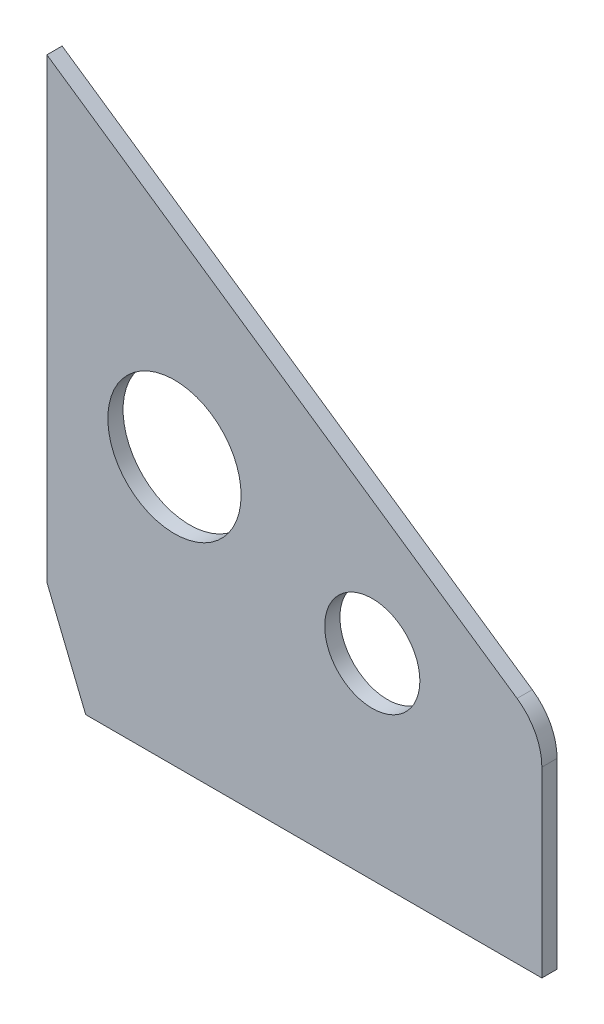
ISO-10303-21;
HEADER;
FILE_DESCRIPTION(('STEP AP214'),'2;1');
FILE_NAME('part.step','',(''),(''),'','','');
FILE_SCHEMA(('AUTOMOTIVE_DESIGN { 1 0 10303 214 1 1 1 1 }'));
ENDSEC;
DATA;
#1=APPLICATION_CONTEXT('core data for automotive mechanical design processes');
#2=APPLICATION_PROTOCOL_DEFINITION('international standard','automotive_design',2000,#1);
#3=PRODUCT_CONTEXT('',#1,'mechanical');
#4=PRODUCT('Part','Part','',(#3));
#5=PRODUCT_RELATED_PRODUCT_CATEGORY('part','',(#4));
#6=PRODUCT_DEFINITION_FORMATION('','',#4);
#7=PRODUCT_DEFINITION_CONTEXT('part definition',#1,'design');
#8=PRODUCT_DEFINITION('design','',#6,#7);
#9=PRODUCT_DEFINITION_SHAPE('','',#8);
#10=(LENGTH_UNIT() NAMED_UNIT(*) SI_UNIT(.MILLI.,.METRE.));
#11=(NAMED_UNIT(*) PLANE_ANGLE_UNIT() SI_UNIT($,.RADIAN.));
#12=(NAMED_UNIT(*) SI_UNIT($,.STERADIAN.) SOLID_ANGLE_UNIT());
#13=UNCERTAINTY_MEASURE_WITH_UNIT(LENGTH_MEASURE(1.E-05),#10,'distance_accuracy_value','');
#14=(GEOMETRIC_REPRESENTATION_CONTEXT(3) GLOBAL_UNCERTAINTY_ASSIGNED_CONTEXT((#13)) GLOBAL_UNIT_ASSIGNED_CONTEXT((#10,
#11,#12)) REPRESENTATION_CONTEXT('',''));
#15=CARTESIAN_POINT('',(0.,0.,0.));
#16=DIRECTION('',(0.,0.,1.));
#17=DIRECTION('',(1.,0.,0.));
#18=AXIS2_PLACEMENT_3D('',#15,#16,#17);
#19=CARTESIAN_POINT('',(-41.7165214648575,663.250869168476,4.));
#20=DIRECTION('',(0.,0.,1.));
#21=DIRECTION('',(1.,0.,0.));
#22=AXIS2_PLACEMENT_3D('',#19,#20,#21);
#23=PLANE('',#22);
#24=CARTESIAN_POINT('',(-123.214216797386,685.589410404207,4.));
#25=DIRECTION('',(0.,0.,1.));
#26=DIRECTION('',(1.,0.,0.));
#27=AXIS2_PLACEMENT_3D('',#24,#25,#26);
#28=CIRCLE('',#27,17.5);
#29=CARTESIAN_POINT('',(-105.714216797386,685.589410404207,4.));
#30=VERTEX_POINT('',#29);
#31=EDGE_CURVE('E124',#30,#30,#28,.T.);
#32=ORIENTED_EDGE('',*,*,#31,.F.);
#33=EDGE_LOOP('',(#32));
#34=FACE_BOUND('',#33,.T.);
#35=DIRECTION('',(0.,1.,0.));
#36=VECTOR('',#35,1.);
#37=CARTESIAN_POINT('',(-26.7165214648575,663.250869168476,4.));
#38=LINE('',#37,#36);
#39=CARTESIAN_POINT('',(-26.7165214648575,615.290207127279,4.));
#40=VERTEX_POINT('',#39);
#41=CARTESIAN_POINT('',(-26.7165214648574,663.250869168476,4.));
#42=VERTEX_POINT('',#41);
#43=EDGE_CURVE('E131',#40,#42,#38,.T.);
#44=ORIENTED_EDGE('',*,*,#43,.T.);
#45=CARTESIAN_POINT('',(-41.7165214648575,663.250869168476,4.));
#46=DIRECTION('',(0.,0.,1.));
#47=DIRECTION('',(1.,0.,0.));
#48=AXIS2_PLACEMENT_3D('',#45,#46,#47);
#49=CIRCLE('',#48,15.);
#50=CARTESIAN_POINT('',(-33.2339777940577,675.62206364892,4.));
#51=VERTEX_POINT('',#50);
#52=EDGE_CURVE('E89',#42,#51,#49,.T.);
#53=ORIENTED_EDGE('',*,*,#52,.T.);
#54=DIRECTION('',(-0.824746298696301,0.565502911386627,0.));
#55=VECTOR('',#54,1.);
#56=CARTESIAN_POINT('',(-156.716521464857,760.290207127278,4.));
#57=LINE('',#56,#55);
#58=CARTESIAN_POINT('',(-156.716521464857,760.290207127278,4.));
#59=VERTEX_POINT('',#58);
#60=EDGE_CURVE('E102',#51,#59,#57,.T.);
#61=ORIENTED_EDGE('',*,*,#60,.T.);
#62=DIRECTION('',(0.,-1.,0.));
#63=VECTOR('',#62,1.);
#64=CARTESIAN_POINT('',(-156.716521464857,760.290207127278,4.));
#65=LINE('',#64,#63);
#66=CARTESIAN_POINT('',(-156.716521464857,640.290207127278,4.));
#67=VERTEX_POINT('',#66);
#68=EDGE_CURVE('E96',#59,#67,#65,.T.);
#69=ORIENTED_EDGE('',*,*,#68,.T.);
#70=DIRECTION('',(0.377198110779915,-0.926132595919215,0.));
#71=VECTOR('',#70,1.);
#72=CARTESIAN_POINT('',(-156.716521464857,640.290207127278,4.));
#73=LINE('',#72,#71);
#74=CARTESIAN_POINT('',(-146.534445149815,615.290207127279,4.));
#75=VERTEX_POINT('',#74);
#76=EDGE_CURVE('E100',#67,#75,#73,.T.);
#77=ORIENTED_EDGE('',*,*,#76,.T.);
#78=DIRECTION('',(1.,0.,0.));
#79=VECTOR('',#78,1.);
#80=CARTESIAN_POINT('',(-26.7165214648575,615.290207127279,4.));
#81=LINE('',#80,#79);
#82=EDGE_CURVE('E52',#75,#40,#81,.T.);
#83=ORIENTED_EDGE('',*,*,#82,.T.);
#84=EDGE_LOOP('',(#44,#53,#61,#69,#77,#83));
#85=FACE_BOUND('',#84,.T.);
#86=CARTESIAN_POINT('',(-71.2580914007588,666.840828083265,4.));
#87=DIRECTION('',(0.,0.,1.));
#88=DIRECTION('',(1.,0.,0.));
#89=AXIS2_PLACEMENT_3D('',#86,#87,#88);
#90=CIRCLE('',#89,12.5);
#91=CARTESIAN_POINT('',(-58.7580914007588,666.840828083265,4.));
#92=VERTEX_POINT('',#91);
#93=EDGE_CURVE('E173',#92,#92,#90,.T.);
#94=ORIENTED_EDGE('',*,*,#93,.F.);
#95=EDGE_LOOP('',(#94));
#96=FACE_BOUND('',#95,.T.);
#97=ADVANCED_FACE('F35',(#34,#85,#96),#23,.T.);
#98=CARTESIAN_POINT('',(-41.7165214648575,663.250869168476,0.));
#99=DIRECTION('',(0.,0.,1.));
#100=DIRECTION('',(1.,0.,0.));
#101=AXIS2_PLACEMENT_3D('',#98,#99,#100);
#102=PLANE('',#101);
#103=DIRECTION('',(0.,1.,0.));
#104=VECTOR('',#103,1.);
#105=CARTESIAN_POINT('',(-26.7165214648575,663.250869168476,0.));
#106=LINE('',#105,#104);
#107=CARTESIAN_POINT('',(-26.7165214648575,615.290207127279,0.));
#108=VERTEX_POINT('',#107);
#109=CARTESIAN_POINT('',(-26.7165214648574,663.250869168476,0.));
#110=VERTEX_POINT('',#109);
#111=EDGE_CURVE('E120',#108,#110,#106,.T.);
#112=ORIENTED_EDGE('',*,*,#111,.F.);
#113=DIRECTION('',(1.,0.,0.));
#114=VECTOR('',#113,1.);
#115=CARTESIAN_POINT('',(-26.7165214648575,615.290207127279,0.));
#116=LINE('',#115,#114);
#117=CARTESIAN_POINT('',(-146.534445149815,615.290207127279,0.));
#118=VERTEX_POINT('',#117);
#119=EDGE_CURVE('E81',#118,#108,#116,.T.);
#120=ORIENTED_EDGE('',*,*,#119,.F.);
#121=DIRECTION('',(0.377198110779915,-0.926132595919215,0.));
#122=VECTOR('',#121,1.);
#123=CARTESIAN_POINT('',(-156.716521464857,640.290207127278,0.));
#124=LINE('',#123,#122);
#125=CARTESIAN_POINT('',(-156.716521464857,640.290207127278,0.));
#126=VERTEX_POINT('',#125);
#127=EDGE_CURVE('E75',#126,#118,#124,.T.);
#128=ORIENTED_EDGE('',*,*,#127,.F.);
#129=DIRECTION('',(0.,-1.,0.));
#130=VECTOR('',#129,1.);
#131=CARTESIAN_POINT('',(-156.716521464857,760.290207127278,0.));
#132=LINE('',#131,#130);
#133=CARTESIAN_POINT('',(-156.716521464857,760.290207127278,0.));
#134=VERTEX_POINT('',#133);
#135=EDGE_CURVE('E110',#134,#126,#132,.T.);
#136=ORIENTED_EDGE('',*,*,#135,.F.);
#137=DIRECTION('',(-0.824746298696301,0.565502911386627,0.));
#138=VECTOR('',#137,1.);
#139=CARTESIAN_POINT('',(-156.716521464857,760.290207127278,0.));
#140=LINE('',#139,#138);
#141=CARTESIAN_POINT('',(-33.2339777940577,675.62206364892,0.));
#142=VERTEX_POINT('',#141);
#143=EDGE_CURVE('E126',#142,#134,#140,.T.);
#144=ORIENTED_EDGE('',*,*,#143,.F.);
#145=CARTESIAN_POINT('',(-41.7165214648575,663.250869168476,0.));
#146=DIRECTION('',(0.,0.,1.));
#147=DIRECTION('',(1.,0.,0.));
#148=AXIS2_PLACEMENT_3D('',#145,#146,#147);
#149=CIRCLE('',#148,15.);
#150=EDGE_CURVE('E123',#110,#142,#149,.T.);
#151=ORIENTED_EDGE('',*,*,#150,.F.);
#152=EDGE_LOOP('',(#112,#120,#128,#136,#144,#151));
#153=FACE_BOUND('',#152,.T.);
#154=CARTESIAN_POINT('',(-123.214216797386,685.589410404207,0.));
#155=DIRECTION('',(0.,0.,1.));
#156=DIRECTION('',(1.,0.,0.));
#157=AXIS2_PLACEMENT_3D('',#154,#155,#156);
#158=CIRCLE('',#157,17.5);
#159=CARTESIAN_POINT('',(-105.714216797386,685.589410404207,0.));
#160=VERTEX_POINT('',#159);
#161=EDGE_CURVE('E179',#160,#160,#158,.T.);
#162=ORIENTED_EDGE('',*,*,#161,.T.);
#163=EDGE_LOOP('',(#162));
#164=FACE_BOUND('',#163,.T.);
#165=CARTESIAN_POINT('',(-71.2580914007588,666.840828083265,0.));
#166=DIRECTION('',(0.,0.,1.));
#167=DIRECTION('',(1.,0.,0.));
#168=AXIS2_PLACEMENT_3D('',#165,#166,#167);
#169=CIRCLE('',#168,12.5);
#170=CARTESIAN_POINT('',(-58.7580914007588,666.840828083265,0.));
#171=VERTEX_POINT('',#170);
#172=EDGE_CURVE('E176',#171,#171,#169,.T.);
#173=ORIENTED_EDGE('',*,*,#172,.T.);
#174=EDGE_LOOP('',(#173));
#175=FACE_BOUND('',#174,.T.);
#176=ADVANCED_FACE('F140',(#153,#164,#175),#102,.F.);
#177=CARTESIAN_POINT('',(-26.7165214648575,663.250869168476,4.));
#178=DIRECTION('',(-1.,0.,0.));
#179=DIRECTION('',(0.,0.,1.));
#180=AXIS2_PLACEMENT_3D('',#177,#178,#179);
#181=PLANE('',#180);
#182=ORIENTED_EDGE('',*,*,#111,.T.);
#183=DIRECTION('',(0.,0.,-1.));
#184=VECTOR('',#183,1.);
#185=CARTESIAN_POINT('',(-26.7165214648574,663.250869168476,4.));
#186=LINE('',#185,#184);
#187=EDGE_CURVE('E11',#42,#110,#186,.T.);
#188=ORIENTED_EDGE('',*,*,#187,.F.);
#189=ORIENTED_EDGE('',*,*,#43,.F.);
#190=DIRECTION('',(0.,0.,-1.));
#191=VECTOR('',#190,1.);
#192=CARTESIAN_POINT('',(-26.7165214648575,615.290207127279,4.));
#193=LINE('',#192,#191);
#194=EDGE_CURVE('E116',#40,#108,#193,.T.);
#195=ORIENTED_EDGE('',*,*,#194,.T.);
#196=EDGE_LOOP('',(#182,#188,#189,#195));
#197=FACE_BOUND('',#196,.T.);
#198=ADVANCED_FACE('F37',(#197),#181,.F.);
#199=CARTESIAN_POINT('',(-41.7165214648575,663.250869168476,4.));
#200=DIRECTION('',(0.,0.,-1.));
#201=DIRECTION('',(-1.,0.,0.));
#202=AXIS2_PLACEMENT_3D('',#199,#200,#201);
#203=CYLINDRICAL_SURFACE('',#202,15.);
#204=ORIENTED_EDGE('',*,*,#150,.T.);
#205=DIRECTION('',(0.,0.,-1.));
#206=VECTOR('',#205,1.);
#207=CARTESIAN_POINT('',(-33.2339777940577,675.62206364892,4.));
#208=LINE('',#207,#206);
#209=EDGE_CURVE('E44',#51,#142,#208,.T.);
#210=ORIENTED_EDGE('',*,*,#209,.F.);
#211=ORIENTED_EDGE('',*,*,#52,.F.);
#212=ORIENTED_EDGE('',*,*,#187,.T.);
#213=EDGE_LOOP('',(#204,#210,#211,#212));
#214=FACE_BOUND('',#213,.T.);
#215=ADVANCED_FACE('F220',(#214),#203,.T.);
#216=CARTESIAN_POINT('',(-156.716521464857,760.290207127278,4.));
#217=DIRECTION('',(-0.565502911386627,-0.824746298696301,0.));
#218=DIRECTION('',(0.824746298696301,-0.565502911386627,0.));
#219=AXIS2_PLACEMENT_3D('',#216,#217,#218);
#220=PLANE('',#219);
#221=ORIENTED_EDGE('',*,*,#143,.T.);
#222=DIRECTION('',(0.,0.,-1.));
#223=VECTOR('',#222,1.);
#224=CARTESIAN_POINT('',(-156.716521464857,760.290207127278,4.));
#225=LINE('',#224,#223);
#226=EDGE_CURVE('E111',#59,#134,#225,.T.);
#227=ORIENTED_EDGE('',*,*,#226,.F.);
#228=ORIENTED_EDGE('',*,*,#60,.F.);
#229=ORIENTED_EDGE('',*,*,#209,.T.);
#230=EDGE_LOOP('',(#221,#227,#228,#229));
#231=FACE_BOUND('',#230,.T.);
#232=ADVANCED_FACE('F137',(#231),#220,.F.);
#233=CARTESIAN_POINT('',(-156.716521464857,760.290207127278,4.));
#234=DIRECTION('',(1.,0.,0.));
#235=DIRECTION('',(0.,0.,-1.));
#236=AXIS2_PLACEMENT_3D('',#233,#234,#235);
#237=PLANE('',#236);
#238=ORIENTED_EDGE('',*,*,#135,.T.);
#239=DIRECTION('',(0.,0.,-1.));
#240=VECTOR('',#239,1.);
#241=CARTESIAN_POINT('',(-156.716521464857,640.290207127278,4.));
#242=LINE('',#241,#240);
#243=EDGE_CURVE('E107',#67,#126,#242,.T.);
#244=ORIENTED_EDGE('',*,*,#243,.F.);
#245=ORIENTED_EDGE('',*,*,#68,.F.);
#246=ORIENTED_EDGE('',*,*,#226,.T.);
#247=EDGE_LOOP('',(#238,#244,#245,#246));
#248=FACE_BOUND('',#247,.T.);
#249=ADVANCED_FACE('F108',(#248),#237,.F.);
#250=CARTESIAN_POINT('',(-156.716521464857,640.290207127278,4.));
#251=DIRECTION('',(0.926132595919215,0.377198110779915,0.));
#252=DIRECTION('',(-0.377198110779915,0.926132595919215,0.));
#253=AXIS2_PLACEMENT_3D('',#250,#251,#252);
#254=PLANE('',#253);
#255=ORIENTED_EDGE('',*,*,#127,.T.);
#256=DIRECTION('',(0.,0.,-1.));
#257=VECTOR('',#256,1.);
#258=CARTESIAN_POINT('',(-146.534445149815,615.290207127279,4.));
#259=LINE('',#258,#257);
#260=EDGE_CURVE('E112',#75,#118,#259,.T.);
#261=ORIENTED_EDGE('',*,*,#260,.F.);
#262=ORIENTED_EDGE('',*,*,#76,.F.);
#263=ORIENTED_EDGE('',*,*,#243,.T.);
#264=EDGE_LOOP('',(#255,#261,#262,#263));
#265=FACE_BOUND('',#264,.T.);
#266=ADVANCED_FACE('F114',(#265),#254,.F.);
#267=CARTESIAN_POINT('',(-26.7165214648575,615.290207127279,4.));
#268=DIRECTION('',(0.,1.,0.));
#269=DIRECTION('',(0.,0.,1.));
#270=AXIS2_PLACEMENT_3D('',#267,#268,#269);
#271=PLANE('',#270);
#272=ORIENTED_EDGE('',*,*,#119,.T.);
#273=ORIENTED_EDGE('',*,*,#194,.F.);
#274=ORIENTED_EDGE('',*,*,#82,.F.);
#275=ORIENTED_EDGE('',*,*,#260,.T.);
#276=EDGE_LOOP('',(#272,#273,#274,#275));
#277=FACE_BOUND('',#276,.T.);
#278=ADVANCED_FACE('F145',(#277),#271,.F.);
#279=CARTESIAN_POINT('',(-123.214216797386,685.589410404207,4.));
#280=DIRECTION('',(0.,0.,-1.));
#281=DIRECTION('',(-1.,0.,0.));
#282=AXIS2_PLACEMENT_3D('',#279,#280,#281);
#283=CYLINDRICAL_SURFACE('',#282,17.5);
#284=ORIENTED_EDGE('',*,*,#31,.T.);
#285=EDGE_LOOP('',(#284));
#286=FACE_BOUND('',#285,.T.);
#287=ORIENTED_EDGE('',*,*,#161,.F.);
#288=EDGE_LOOP('',(#287));
#289=FACE_BOUND('',#288,.T.);
#290=ADVANCED_FACE('F147',(#286,#289),#283,.F.);
#291=CARTESIAN_POINT('',(-71.2580914007588,666.840828083265,4.));
#292=DIRECTION('',(0.,0.,-1.));
#293=DIRECTION('',(-1.,0.,0.));
#294=AXIS2_PLACEMENT_3D('',#291,#292,#293);
#295=CYLINDRICAL_SURFACE('',#294,12.5);
#296=ORIENTED_EDGE('',*,*,#93,.T.);
#297=EDGE_LOOP('',(#296));
#298=FACE_BOUND('',#297,.T.);
#299=ORIENTED_EDGE('',*,*,#172,.F.);
#300=EDGE_LOOP('',(#299));
#301=FACE_BOUND('',#300,.T.);
#302=ADVANCED_FACE('F153',(#298,#301),#295,.F.);
#303=CLOSED_SHELL('',(#97,#176,#198,#215,#232,#249,#266,#278,#290,#302));
#304=MANIFOLD_SOLID_BREP('B2',#303);
#305=ADVANCED_BREP_SHAPE_REPRESENTATION('',(#18,#304),#14);
#306=SHAPE_DEFINITION_REPRESENTATION(#9,#305);
ENDSEC;
END-ISO-10303-21;
